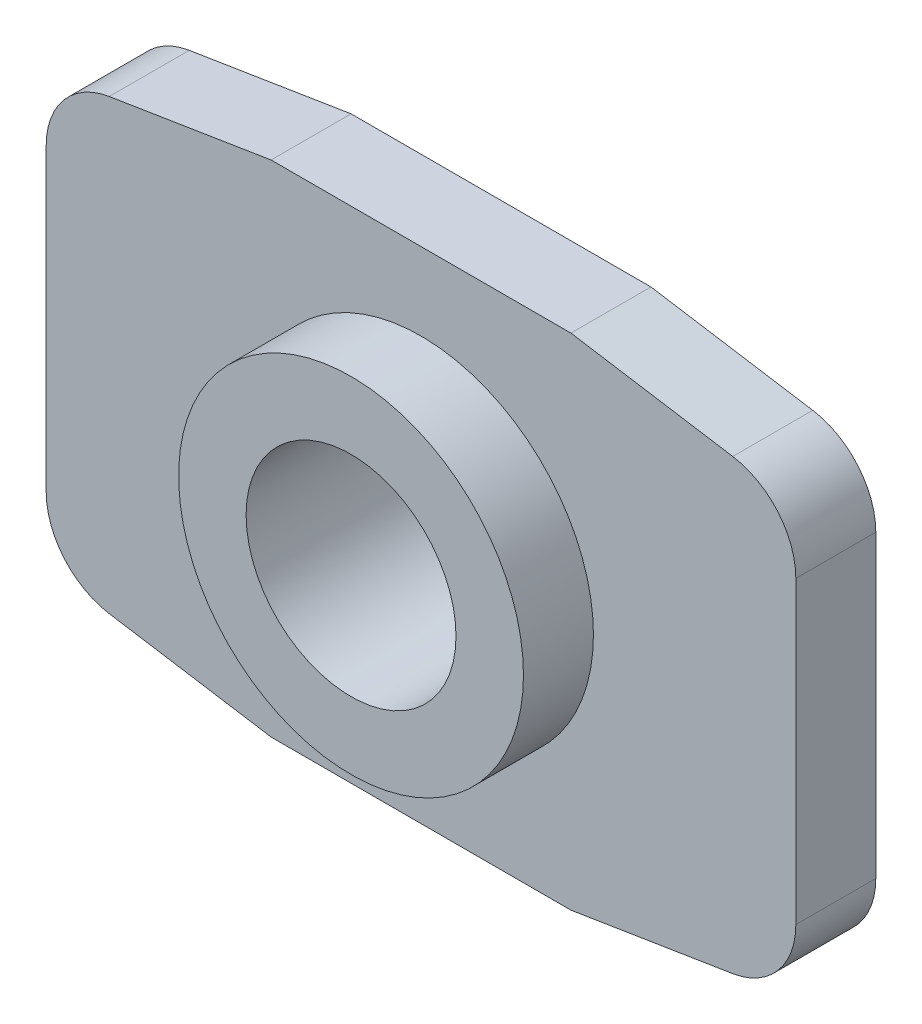
ISO-10303-21;
HEADER;
FILE_DESCRIPTION(('STEP AP214'),'2;1');
FILE_NAME('part.step','',(''),(''),'','','');
FILE_SCHEMA(('AUTOMOTIVE_DESIGN { 1 0 10303 214 1 1 1 1 }'));
ENDSEC;
DATA;
#1=APPLICATION_CONTEXT('core data for automotive mechanical design processes');
#2=APPLICATION_PROTOCOL_DEFINITION('international standard','automotive_design',2000,#1);
#3=PRODUCT_CONTEXT('',#1,'mechanical');
#4=PRODUCT('Part','Part','',(#3));
#5=PRODUCT_RELATED_PRODUCT_CATEGORY('part','',(#4));
#6=PRODUCT_DEFINITION_FORMATION('','',#4);
#7=PRODUCT_DEFINITION_CONTEXT('part definition',#1,'design');
#8=PRODUCT_DEFINITION('design','',#6,#7);
#9=PRODUCT_DEFINITION_SHAPE('','',#8);
#10=(LENGTH_UNIT() NAMED_UNIT(*) SI_UNIT(.MILLI.,.METRE.));
#11=(NAMED_UNIT(*) PLANE_ANGLE_UNIT() SI_UNIT($,.RADIAN.));
#12=(NAMED_UNIT(*) SI_UNIT($,.STERADIAN.) SOLID_ANGLE_UNIT());
#13=UNCERTAINTY_MEASURE_WITH_UNIT(LENGTH_MEASURE(1.E-05),#10,'distance_accuracy_value','');
#14=(GEOMETRIC_REPRESENTATION_CONTEXT(3) GLOBAL_UNCERTAINTY_ASSIGNED_CONTEXT((#13)) GLOBAL_UNIT_ASSIGNED_CONTEXT((#10,
#11,#12)) REPRESENTATION_CONTEXT('',''));
#15=CARTESIAN_POINT('',(0.,0.,0.));
#16=DIRECTION('',(0.,0.,1.));
#17=DIRECTION('',(1.,0.,0.));
#18=AXIS2_PLACEMENT_3D('',#15,#16,#17);
#19=CARTESIAN_POINT('',(6.,3.,1.6));
#20=DIRECTION('',(0.,0.,1.));
#21=DIRECTION('',(1.,0.,0.));
#22=AXIS2_PLACEMENT_3D('',#19,#20,#21);
#23=PLANE('',#22);
#24=CARTESIAN_POINT('',(6.,3.,1.6));
#25=DIRECTION('',(0.,0.,1.));
#26=DIRECTION('',(1.,0.,0.));
#27=AXIS2_PLACEMENT_3D('',#24,#25,#26);
#28=CIRCLE('',#27,1.5);
#29=CARTESIAN_POINT('',(7.5,3.,1.6));
#30=VERTEX_POINT('',#29);
#31=CARTESIAN_POINT('',(6.23739675280407,4.48109512920611,1.6));
#32=VERTEX_POINT('',#31);
#33=EDGE_CURVE('E200',#30,#32,#28,.T.);
#34=ORIENTED_EDGE('',*,*,#33,.T.);
#35=DIRECTION('',(-0.987396752804077,0.158264501869385,0.));
#36=VECTOR('',#35,1.);
#37=CARTESIAN_POINT('',(6.23739675280407,4.48109512920611,1.6));
#38=LINE('',#37,#36);
#39=CARTESIAN_POINT('',(3.,5.,1.6));
#40=VERTEX_POINT('',#39);
#41=EDGE_CURVE('E109',#32,#40,#38,.T.);
#42=ORIENTED_EDGE('',*,*,#41,.T.);
#43=DIRECTION('',(-1.,0.,0.));
#44=VECTOR('',#43,1.);
#45=CARTESIAN_POINT('',(-3.,5.,1.6));
#46=LINE('',#45,#44);
#47=CARTESIAN_POINT('',(-3.,5.,1.6));
#48=VERTEX_POINT('',#47);
#49=EDGE_CURVE('E237',#40,#48,#46,.T.);
#50=ORIENTED_EDGE('',*,*,#49,.T.);
#51=DIRECTION('',(-0.987396752804077,-0.158264501869386,0.));
#52=VECTOR('',#51,1.);
#53=CARTESIAN_POINT('',(-6.23739675280407,4.48109512920611,1.6));
#54=LINE('',#53,#52);
#55=CARTESIAN_POINT('',(-6.23739675280407,4.48109512920611,1.6));
#56=VERTEX_POINT('',#55);
#57=EDGE_CURVE('E256',#48,#56,#54,.T.);
#58=ORIENTED_EDGE('',*,*,#57,.T.);
#59=CARTESIAN_POINT('',(-6.,3.,1.6));
#60=DIRECTION('',(0.,0.,1.));
#61=DIRECTION('',(-1.,0.,0.));
#62=AXIS2_PLACEMENT_3D('',#59,#60,#61);
#63=CIRCLE('',#62,1.5);
#64=CARTESIAN_POINT('',(-7.5,3.,1.6));
#65=VERTEX_POINT('',#64);
#66=EDGE_CURVE('E252',#56,#65,#63,.T.);
#67=ORIENTED_EDGE('',*,*,#66,.T.);
#68=DIRECTION('',(0.,-1.,0.));
#69=VECTOR('',#68,1.);
#70=CARTESIAN_POINT('',(-7.5,-3.,1.6));
#71=LINE('',#70,#69);
#72=CARTESIAN_POINT('',(-7.5,-3.,1.6));
#73=VERTEX_POINT('',#72);
#74=EDGE_CURVE('E255',#65,#73,#71,.T.);
#75=ORIENTED_EDGE('',*,*,#74,.T.);
#76=CARTESIAN_POINT('',(-6.,-3.,1.6));
#77=DIRECTION('',(0.,0.,1.));
#78=DIRECTION('',(1.,0.,0.));
#79=AXIS2_PLACEMENT_3D('',#76,#77,#78);
#80=CIRCLE('',#79,1.5);
#81=CARTESIAN_POINT('',(-6.23739675280407,-4.48109512920612,1.6));
#82=VERTEX_POINT('',#81);
#83=EDGE_CURVE('E261',#73,#82,#80,.T.);
#84=ORIENTED_EDGE('',*,*,#83,.T.);
#85=DIRECTION('',(0.987396752804077,-0.158264501869385,0.));
#86=VECTOR('',#85,1.);
#87=CARTESIAN_POINT('',(-6.23739675280407,-4.48109512920612,1.6));
#88=LINE('',#87,#86);
#89=CARTESIAN_POINT('',(-3.,-5.,1.6));
#90=VERTEX_POINT('',#89);
#91=EDGE_CURVE('E269',#82,#90,#88,.T.);
#92=ORIENTED_EDGE('',*,*,#91,.T.);
#93=DIRECTION('',(1.,0.,0.));
#94=VECTOR('',#93,1.);
#95=CARTESIAN_POINT('',(-3.,-5.,1.6));
#96=LINE('',#95,#94);
#97=CARTESIAN_POINT('',(3.,-5.,1.6));
#98=VERTEX_POINT('',#97);
#99=EDGE_CURVE('E140',#90,#98,#96,.T.);
#100=ORIENTED_EDGE('',*,*,#99,.T.);
#101=DIRECTION('',(0.987396752804077,0.158264501869385,0.));
#102=VECTOR('',#101,1.);
#103=CARTESIAN_POINT('',(6.23739675280407,-4.48109512920611,1.6));
#104=LINE('',#103,#102);
#105=CARTESIAN_POINT('',(6.23739675280407,-4.48109512920612,1.6));
#106=VERTEX_POINT('',#105);
#107=EDGE_CURVE('E134',#98,#106,#104,.T.);
#108=ORIENTED_EDGE('',*,*,#107,.T.);
#109=CARTESIAN_POINT('',(6.,-3.,1.6));
#110=DIRECTION('',(0.,0.,1.));
#111=DIRECTION('',(-1.,0.,0.));
#112=AXIS2_PLACEMENT_3D('',#109,#110,#111);
#113=CIRCLE('',#112,1.5);
#114=CARTESIAN_POINT('',(7.5,-3.,1.6));
#115=VERTEX_POINT('',#114);
#116=EDGE_CURVE('E138',#106,#115,#113,.T.);
#117=ORIENTED_EDGE('',*,*,#116,.T.);
#118=DIRECTION('',(0.,1.,0.));
#119=VECTOR('',#118,1.);
#120=CARTESIAN_POINT('',(7.5,-3.,1.6));
#121=LINE('',#120,#119);
#122=EDGE_CURVE('E54',#115,#30,#121,.T.);
#123=ORIENTED_EDGE('',*,*,#122,.T.);
#124=EDGE_LOOP('',(#34,#42,#50,#58,#67,#75,#84,#92,#100,#108,#117,#123));
#125=FACE_BOUND('',#124,.T.);
#126=CARTESIAN_POINT('',(0.,0.,1.6));
#127=DIRECTION('',(0.,0.,1.));
#128=DIRECTION('',(1.,0.,0.));
#129=AXIS2_PLACEMENT_3D('',#126,#127,#128);
#130=CIRCLE('',#129,3.45);
#131=CARTESIAN_POINT('',(3.45,0.,1.6));
#132=VERTEX_POINT('',#131);
#133=EDGE_CURVE('E279',#132,#132,#130,.T.);
#134=ORIENTED_EDGE('',*,*,#133,.F.);
#135=EDGE_LOOP('',(#134));
#136=FACE_BOUND('',#135,.T.);
#137=ADVANCED_FACE('F36',(#125,#136),#23,.T.);
#138=CARTESIAN_POINT('',(6.,3.,1.6));
#139=DIRECTION('',(0.,0.,-1.));
#140=DIRECTION('',(-1.,0.,0.));
#141=AXIS2_PLACEMENT_3D('',#138,#139,#140);
#142=CYLINDRICAL_SURFACE('',#141,1.5);
#143=CARTESIAN_POINT('',(6.,3.,0.));
#144=DIRECTION('',(0.,0.,1.));
#145=DIRECTION('',(1.,0.,0.));
#146=AXIS2_PLACEMENT_3D('',#143,#144,#145);
#147=CIRCLE('',#146,1.5);
#148=CARTESIAN_POINT('',(7.5,3.,0.));
#149=VERTEX_POINT('',#148);
#150=CARTESIAN_POINT('',(6.23739675280407,4.48109512920611,0.));
#151=VERTEX_POINT('',#150);
#152=EDGE_CURVE('E165',#149,#151,#147,.T.);
#153=ORIENTED_EDGE('',*,*,#152,.T.);
#154=DIRECTION('',(0.,0.,-1.));
#155=VECTOR('',#154,1.);
#156=CARTESIAN_POINT('',(6.23739675280407,4.48109512920611,1.6));
#157=LINE('',#156,#155);
#158=EDGE_CURVE('E11',#32,#151,#157,.T.);
#159=ORIENTED_EDGE('',*,*,#158,.F.);
#160=ORIENTED_EDGE('',*,*,#33,.F.);
#161=DIRECTION('',(0.,0.,-1.));
#162=VECTOR('',#161,1.);
#163=CARTESIAN_POINT('',(7.5,3.,1.6));
#164=LINE('',#163,#162);
#165=EDGE_CURVE('E161',#30,#149,#164,.T.);
#166=ORIENTED_EDGE('',*,*,#165,.T.);
#167=EDGE_LOOP('',(#153,#159,#160,#166));
#168=FACE_BOUND('',#167,.T.);
#169=ADVANCED_FACE('F38',(#168),#142,.T.);
#170=CARTESIAN_POINT('',(6.23739675280407,4.48109512920611,1.6));
#171=DIRECTION('',(-0.158264501869385,-0.987396752804077,0.));
#172=DIRECTION('',(0.987396752804077,-0.158264501869385,0.));
#173=AXIS2_PLACEMENT_3D('',#170,#171,#172);
#174=PLANE('',#173);
#175=DIRECTION('',(-0.987396752804077,0.158264501869385,0.));
#176=VECTOR('',#175,1.);
#177=CARTESIAN_POINT('',(6.23739675280407,4.48109512920611,0.));
#178=LINE('',#177,#176);
#179=CARTESIAN_POINT('',(3.,5.,0.));
#180=VERTEX_POINT('',#179);
#181=EDGE_CURVE('E169',#151,#180,#178,.T.);
#182=ORIENTED_EDGE('',*,*,#181,.T.);
#183=DIRECTION('',(0.,0.,-1.));
#184=VECTOR('',#183,1.);
#185=CARTESIAN_POINT('',(3.,5.,1.6));
#186=LINE('',#185,#184);
#187=EDGE_CURVE('E46',#40,#180,#186,.T.);
#188=ORIENTED_EDGE('',*,*,#187,.F.);
#189=ORIENTED_EDGE('',*,*,#41,.F.);
#190=ORIENTED_EDGE('',*,*,#158,.T.);
#191=EDGE_LOOP('',(#182,#188,#189,#190));
#192=FACE_BOUND('',#191,.T.);
#193=ADVANCED_FACE('F308',(#192),#174,.F.);
#194=CARTESIAN_POINT('',(-3.,5.,1.6));
#195=DIRECTION('',(0.,-1.,0.));
#196=DIRECTION('',(0.,0.,-1.));
#197=AXIS2_PLACEMENT_3D('',#194,#195,#196);
#198=PLANE('',#197);
#199=DIRECTION('',(-1.,0.,0.));
#200=VECTOR('',#199,1.);
#201=CARTESIAN_POINT('',(-3.,5.,0.));
#202=LINE('',#201,#200);
#203=CARTESIAN_POINT('',(-3.,5.,0.));
#204=VERTEX_POINT('',#203);
#205=EDGE_CURVE('E173',#180,#204,#202,.T.);
#206=ORIENTED_EDGE('',*,*,#205,.T.);
#207=DIRECTION('',(0.,0.,-1.));
#208=VECTOR('',#207,1.);
#209=CARTESIAN_POINT('',(-3.,5.,1.6));
#210=LINE('',#209,#208);
#211=EDGE_CURVE('E226',#48,#204,#210,.T.);
#212=ORIENTED_EDGE('',*,*,#211,.F.);
#213=ORIENTED_EDGE('',*,*,#49,.F.);
#214=ORIENTED_EDGE('',*,*,#187,.T.);
#215=EDGE_LOOP('',(#206,#212,#213,#214));
#216=FACE_BOUND('',#215,.T.);
#217=ADVANCED_FACE('F235',(#216),#198,.F.);
#218=CARTESIAN_POINT('',(-6.23739675280407,4.48109512920611,1.6));
#219=DIRECTION('',(0.158264501869386,-0.987396752804077,0.));
#220=DIRECTION('',(0.987396752804077,0.158264501869386,0.));
#221=AXIS2_PLACEMENT_3D('',#218,#219,#220);
#222=PLANE('',#221);
#223=DIRECTION('',(-0.987396752804077,-0.158264501869386,0.));
#224=VECTOR('',#223,1.);
#225=CARTESIAN_POINT('',(-6.23739675280407,4.48109512920611,0.));
#226=LINE('',#225,#224);
#227=CARTESIAN_POINT('',(-6.23739675280407,4.48109512920611,0.));
#228=VERTEX_POINT('',#227);
#229=EDGE_CURVE('E176',#204,#228,#226,.T.);
#230=ORIENTED_EDGE('',*,*,#229,.T.);
#231=DIRECTION('',(0.,0.,-1.));
#232=VECTOR('',#231,1.);
#233=CARTESIAN_POINT('',(-6.23739675280407,4.48109512920611,1.6));
#234=LINE('',#233,#232);
#235=EDGE_CURVE('E222',#56,#228,#234,.T.);
#236=ORIENTED_EDGE('',*,*,#235,.F.);
#237=ORIENTED_EDGE('',*,*,#57,.F.);
#238=ORIENTED_EDGE('',*,*,#211,.T.);
#239=EDGE_LOOP('',(#230,#236,#237,#238));
#240=FACE_BOUND('',#239,.T.);
#241=ADVANCED_FACE('F246',(#240),#222,.F.);
#242=CARTESIAN_POINT('',(-6.,3.,1.6));
#243=DIRECTION('',(0.,0.,-1.));
#244=DIRECTION('',(-1.,0.,0.));
#245=AXIS2_PLACEMENT_3D('',#242,#243,#244);
#246=CYLINDRICAL_SURFACE('',#245,1.5);
#247=CARTESIAN_POINT('',(-6.,3.,0.));
#248=DIRECTION('',(0.,0.,1.));
#249=DIRECTION('',(-1.,0.,0.));
#250=AXIS2_PLACEMENT_3D('',#247,#248,#249);
#251=CIRCLE('',#250,1.5);
#252=CARTESIAN_POINT('',(-7.5,3.,0.));
#253=VERTEX_POINT('',#252);
#254=EDGE_CURVE('E179',#228,#253,#251,.T.);
#255=ORIENTED_EDGE('',*,*,#254,.T.);
#256=DIRECTION('',(0.,0.,-1.));
#257=VECTOR('',#256,1.);
#258=CARTESIAN_POINT('',(-7.5,3.,1.6));
#259=LINE('',#258,#257);
#260=EDGE_CURVE('E218',#65,#253,#259,.T.);
#261=ORIENTED_EDGE('',*,*,#260,.F.);
#262=ORIENTED_EDGE('',*,*,#66,.F.);
#263=ORIENTED_EDGE('',*,*,#235,.T.);
#264=EDGE_LOOP('',(#255,#261,#262,#263));
#265=FACE_BOUND('',#264,.T.);
#266=ADVANCED_FACE('F250',(#265),#246,.T.);
#267=CARTESIAN_POINT('',(-7.5,-3.,1.6));
#268=DIRECTION('',(1.,0.,0.));
#269=DIRECTION('',(0.,0.,-1.));
#270=AXIS2_PLACEMENT_3D('',#267,#268,#269);
#271=PLANE('',#270);
#272=DIRECTION('',(0.,-1.,0.));
#273=VECTOR('',#272,1.);
#274=CARTESIAN_POINT('',(-7.5,-3.,0.));
#275=LINE('',#274,#273);
#276=CARTESIAN_POINT('',(-7.5,-3.,0.));
#277=VERTEX_POINT('',#276);
#278=EDGE_CURVE('E182',#253,#277,#275,.T.);
#279=ORIENTED_EDGE('',*,*,#278,.T.);
#280=DIRECTION('',(0.,0.,-1.));
#281=VECTOR('',#280,1.);
#282=CARTESIAN_POINT('',(-7.5,-3.,1.6));
#283=LINE('',#282,#281);
#284=EDGE_CURVE('E215',#73,#277,#283,.T.);
#285=ORIENTED_EDGE('',*,*,#284,.F.);
#286=ORIENTED_EDGE('',*,*,#74,.F.);
#287=ORIENTED_EDGE('',*,*,#260,.T.);
#288=EDGE_LOOP('',(#279,#285,#286,#287));
#289=FACE_BOUND('',#288,.T.);
#290=ADVANCED_FACE('F344',(#289),#271,.F.);
#291=CARTESIAN_POINT('',(-6.,-3.,1.6));
#292=DIRECTION('',(0.,0.,-1.));
#293=DIRECTION('',(-1.,0.,0.));
#294=AXIS2_PLACEMENT_3D('',#291,#292,#293);
#295=CYLINDRICAL_SURFACE('',#294,1.5);
#296=CARTESIAN_POINT('',(-6.,-3.,0.));
#297=DIRECTION('',(0.,0.,1.));
#298=DIRECTION('',(1.,0.,0.));
#299=AXIS2_PLACEMENT_3D('',#296,#297,#298);
#300=CIRCLE('',#299,1.5);
#301=CARTESIAN_POINT('',(-6.23739675280407,-4.48109512920612,0.));
#302=VERTEX_POINT('',#301);
#303=EDGE_CURVE('E185',#277,#302,#300,.T.);
#304=ORIENTED_EDGE('',*,*,#303,.T.);
#305=DIRECTION('',(0.,0.,-1.));
#306=VECTOR('',#305,1.);
#307=CARTESIAN_POINT('',(-6.23739675280407,-4.48109512920612,1.6));
#308=LINE('',#307,#306);
#309=EDGE_CURVE('E211',#82,#302,#308,.T.);
#310=ORIENTED_EDGE('',*,*,#309,.F.);
#311=ORIENTED_EDGE('',*,*,#83,.F.);
#312=ORIENTED_EDGE('',*,*,#284,.T.);
#313=EDGE_LOOP('',(#304,#310,#311,#312));
#314=FACE_BOUND('',#313,.T.);
#315=ADVANCED_FACE('F340',(#314),#295,.T.);
#316=CARTESIAN_POINT('',(-6.23739675280407,-4.48109512920612,1.6));
#317=DIRECTION('',(0.158264501869385,0.987396752804077,0.));
#318=DIRECTION('',(-0.987396752804077,0.158264501869385,0.));
#319=AXIS2_PLACEMENT_3D('',#316,#317,#318);
#320=PLANE('',#319);
#321=DIRECTION('',(0.987396752804077,-0.158264501869385,0.));
#322=VECTOR('',#321,1.);
#323=CARTESIAN_POINT('',(-6.23739675280407,-4.48109512920612,0.));
#324=LINE('',#323,#322);
#325=CARTESIAN_POINT('',(-3.,-5.,0.));
#326=VERTEX_POINT('',#325);
#327=EDGE_CURVE('E188',#302,#326,#324,.T.);
#328=ORIENTED_EDGE('',*,*,#327,.T.);
#329=DIRECTION('',(0.,0.,-1.));
#330=VECTOR('',#329,1.);
#331=CARTESIAN_POINT('',(-3.,-5.,1.6));
#332=LINE('',#331,#330);
#333=EDGE_CURVE('E207',#90,#326,#332,.T.);
#334=ORIENTED_EDGE('',*,*,#333,.F.);
#335=ORIENTED_EDGE('',*,*,#91,.F.);
#336=ORIENTED_EDGE('',*,*,#309,.T.);
#337=EDGE_LOOP('',(#328,#334,#335,#336));
#338=FACE_BOUND('',#337,.T.);
#339=ADVANCED_FACE('F336',(#338),#320,.F.);
#340=CARTESIAN_POINT('',(-3.,-5.,1.6));
#341=DIRECTION('',(0.,1.,0.));
#342=DIRECTION('',(0.,0.,1.));
#343=AXIS2_PLACEMENT_3D('',#340,#341,#342);
#344=PLANE('',#343);
#345=DIRECTION('',(1.,0.,0.));
#346=VECTOR('',#345,1.);
#347=CARTESIAN_POINT('',(-3.,-5.,0.));
#348=LINE('',#347,#346);
#349=CARTESIAN_POINT('',(3.,-5.,0.));
#350=VERTEX_POINT('',#349);
#351=EDGE_CURVE('E191',#326,#350,#348,.T.);
#352=ORIENTED_EDGE('',*,*,#351,.T.);
#353=DIRECTION('',(0.,0.,-1.));
#354=VECTOR('',#353,1.);
#355=CARTESIAN_POINT('',(3.,-5.,1.6));
#356=LINE('',#355,#354);
#357=EDGE_CURVE('E151',#98,#350,#356,.T.);
#358=ORIENTED_EDGE('',*,*,#357,.F.);
#359=ORIENTED_EDGE('',*,*,#99,.F.);
#360=ORIENTED_EDGE('',*,*,#333,.T.);
#361=EDGE_LOOP('',(#352,#358,#359,#360));
#362=FACE_BOUND('',#361,.T.);
#363=ADVANCED_FACE('F333',(#362),#344,.F.);
#364=CARTESIAN_POINT('',(6.23739675280407,-4.48109512920611,1.6));
#365=DIRECTION('',(-0.158264501869385,0.987396752804077,0.));
#366=DIRECTION('',(-0.987396752804077,-0.158264501869385,0.));
#367=AXIS2_PLACEMENT_3D('',#364,#365,#366);
#368=PLANE('',#367);
#369=DIRECTION('',(0.987396752804077,0.158264501869385,0.));
#370=VECTOR('',#369,1.);
#371=CARTESIAN_POINT('',(6.23739675280407,-4.48109512920611,0.));
#372=LINE('',#371,#370);
#373=CARTESIAN_POINT('',(6.23739675280407,-4.48109512920612,0.));
#374=VERTEX_POINT('',#373);
#375=EDGE_CURVE('E149',#350,#374,#372,.T.);
#376=ORIENTED_EDGE('',*,*,#375,.T.);
#377=DIRECTION('',(0.,0.,-1.));
#378=VECTOR('',#377,1.);
#379=CARTESIAN_POINT('',(6.23739675280407,-4.48109512920612,1.6));
#380=LINE('',#379,#378);
#381=EDGE_CURVE('E146',#106,#374,#380,.T.);
#382=ORIENTED_EDGE('',*,*,#381,.F.);
#383=ORIENTED_EDGE('',*,*,#107,.F.);
#384=ORIENTED_EDGE('',*,*,#357,.T.);
#385=EDGE_LOOP('',(#376,#382,#383,#384));
#386=FACE_BOUND('',#385,.T.);
#387=ADVANCED_FACE('F147',(#386),#368,.F.);
#388=CARTESIAN_POINT('',(6.,-3.,1.6));
#389=DIRECTION('',(0.,0.,-1.));
#390=DIRECTION('',(-1.,0.,0.));
#391=AXIS2_PLACEMENT_3D('',#388,#389,#390);
#392=CYLINDRICAL_SURFACE('',#391,1.5);
#393=CARTESIAN_POINT('',(6.,-3.,0.));
#394=DIRECTION('',(0.,0.,1.));
#395=DIRECTION('',(-1.,0.,0.));
#396=AXIS2_PLACEMENT_3D('',#393,#394,#395);
#397=CIRCLE('',#396,1.5);
#398=CARTESIAN_POINT('',(7.5,-3.,0.));
#399=VERTEX_POINT('',#398);
#400=EDGE_CURVE('E95',#374,#399,#397,.T.);
#401=ORIENTED_EDGE('',*,*,#400,.T.);
#402=DIRECTION('',(0.,0.,-1.));
#403=VECTOR('',#402,1.);
#404=CARTESIAN_POINT('',(7.5,-3.,1.6));
#405=LINE('',#404,#403);
#406=EDGE_CURVE('E152',#115,#399,#405,.T.);
#407=ORIENTED_EDGE('',*,*,#406,.F.);
#408=ORIENTED_EDGE('',*,*,#116,.F.);
#409=ORIENTED_EDGE('',*,*,#381,.T.);
#410=EDGE_LOOP('',(#401,#407,#408,#409));
#411=FACE_BOUND('',#410,.T.);
#412=ADVANCED_FACE('F154',(#411),#392,.T.);
#413=CARTESIAN_POINT('',(7.5,-3.,1.6));
#414=DIRECTION('',(-1.,0.,0.));
#415=DIRECTION('',(0.,-1.,0.));
#416=AXIS2_PLACEMENT_3D('',#413,#414,#415);
#417=PLANE('',#416);
#418=DIRECTION('',(0.,1.,0.));
#419=VECTOR('',#418,1.);
#420=CARTESIAN_POINT('',(7.5,-3.,0.));
#421=LINE('',#420,#419);
#422=EDGE_CURVE('E101',#399,#149,#421,.T.);
#423=ORIENTED_EDGE('',*,*,#422,.T.);
#424=ORIENTED_EDGE('',*,*,#165,.F.);
#425=ORIENTED_EDGE('',*,*,#122,.F.);
#426=ORIENTED_EDGE('',*,*,#406,.T.);
#427=EDGE_LOOP('',(#423,#424,#425,#426));
#428=FACE_BOUND('',#427,.T.);
#429=ADVANCED_FACE('F325',(#428),#417,.F.);
#430=CARTESIAN_POINT('',(6.,3.,0.));
#431=DIRECTION('',(0.,0.,1.));
#432=DIRECTION('',(1.,0.,0.));
#433=AXIS2_PLACEMENT_3D('',#430,#431,#432);
#434=PLANE('',#433);
#435=CARTESIAN_POINT('',(0.,0.,0.));
#436=DIRECTION('',(0.,0.,1.));
#437=DIRECTION('',(1.,0.,0.));
#438=AXIS2_PLACEMENT_3D('',#435,#436,#437);
#439=CIRCLE('',#438,2.1);
#440=CARTESIAN_POINT('',(2.1,0.,0.));
#441=VERTEX_POINT('',#440);
#442=EDGE_CURVE('E276',#441,#441,#439,.T.);
#443=ORIENTED_EDGE('',*,*,#442,.T.);
#444=EDGE_LOOP('',(#443));
#445=FACE_BOUND('',#444,.T.);
#446=ORIENTED_EDGE('',*,*,#152,.F.);
#447=ORIENTED_EDGE('',*,*,#422,.F.);
#448=ORIENTED_EDGE('',*,*,#400,.F.);
#449=ORIENTED_EDGE('',*,*,#375,.F.);
#450=ORIENTED_EDGE('',*,*,#351,.F.);
#451=ORIENTED_EDGE('',*,*,#327,.F.);
#452=ORIENTED_EDGE('',*,*,#303,.F.);
#453=ORIENTED_EDGE('',*,*,#278,.F.);
#454=ORIENTED_EDGE('',*,*,#254,.F.);
#455=ORIENTED_EDGE('',*,*,#229,.F.);
#456=ORIENTED_EDGE('',*,*,#205,.F.);
#457=ORIENTED_EDGE('',*,*,#181,.F.);
#458=EDGE_LOOP('',(#446,#447,#448,#449,#450,#451,#452,#453,#454,#455,#456,#457));
#459=FACE_BOUND('',#458,.T.);
#460=ADVANCED_FACE('F241',(#445,#459),#434,.F.);
#461=CARTESIAN_POINT('',(0.,0.,3.));
#462=DIRECTION('',(0.,0.,-1.));
#463=DIRECTION('',(-1.,0.,0.));
#464=AXIS2_PLACEMENT_3D('',#461,#462,#463);
#465=CYLINDRICAL_SURFACE('',#464,3.45);
#466=CARTESIAN_POINT('',(0.,0.,3.));
#467=DIRECTION('',(0.,0.,1.));
#468=DIRECTION('',(1.,0.,0.));
#469=AXIS2_PLACEMENT_3D('',#466,#467,#468);
#470=CIRCLE('',#469,3.45);
#471=CARTESIAN_POINT('',(3.45,0.,3.));
#472=VERTEX_POINT('',#471);
#473=EDGE_CURVE('E170',#472,#472,#470,.T.);
#474=ORIENTED_EDGE('',*,*,#473,.F.);
#475=EDGE_LOOP('',(#474));
#476=FACE_BOUND('',#475,.T.);
#477=ORIENTED_EDGE('',*,*,#133,.T.);
#478=EDGE_LOOP('',(#477));
#479=FACE_BOUND('',#478,.T.);
#480=ADVANCED_FACE('F321',(#476,#479),#465,.T.);
#481=CARTESIAN_POINT('',(0.,0.,3.));
#482=DIRECTION('',(0.,0.,1.));
#483=DIRECTION('',(1.,0.,0.));
#484=AXIS2_PLACEMENT_3D('',#481,#482,#483);
#485=PLANE('',#484);
#486=CARTESIAN_POINT('',(0.,0.,3.));
#487=DIRECTION('',(0.,0.,1.));
#488=DIRECTION('',(1.,0.,0.));
#489=AXIS2_PLACEMENT_3D('',#486,#487,#488);
#490=CIRCLE('',#489,2.09999999999999);
#491=CARTESIAN_POINT('',(2.09999999999999,0.,3.));
#492=VERTEX_POINT('',#491);
#493=EDGE_CURVE('E280',#492,#492,#490,.T.);
#494=ORIENTED_EDGE('',*,*,#493,.F.);
#495=EDGE_LOOP('',(#494));
#496=FACE_BOUND('',#495,.T.);
#497=ORIENTED_EDGE('',*,*,#473,.T.);
#498=EDGE_LOOP('',(#497));
#499=FACE_BOUND('',#498,.T.);
#500=ADVANCED_FACE('F399',(#496,#499),#485,.T.);
#501=CARTESIAN_POINT('',(0.,0.,3.));
#502=DIRECTION('',(0.,0.,1.));
#503=DIRECTION('',(1.,0.,0.));
#504=AXIS2_PLACEMENT_3D('',#501,#502,#503);
#505=CYLINDRICAL_SURFACE('',#504,2.09999999999999);
#506=ORIENTED_EDGE('',*,*,#442,.F.);
#507=EDGE_LOOP('',(#506));
#508=FACE_BOUND('',#507,.T.);
#509=ORIENTED_EDGE('',*,*,#493,.T.);
#510=EDGE_LOOP('',(#509));
#511=FACE_BOUND('',#510,.T.);
#512=ADVANCED_FACE('F406',(#508,#511),#505,.F.);
#513=CLOSED_SHELL('',(#137,#169,#193,#217,#241,#266,#290,#315,#339,#363,#387,#412,#429,#460,
#480,#500,#512));
#514=MANIFOLD_SOLID_BREP('B2',#513);
#515=ADVANCED_BREP_SHAPE_REPRESENTATION('',(#18,#514),#14);
#516=SHAPE_DEFINITION_REPRESENTATION(#9,#515);
ENDSEC;
END-ISO-10303-21;
